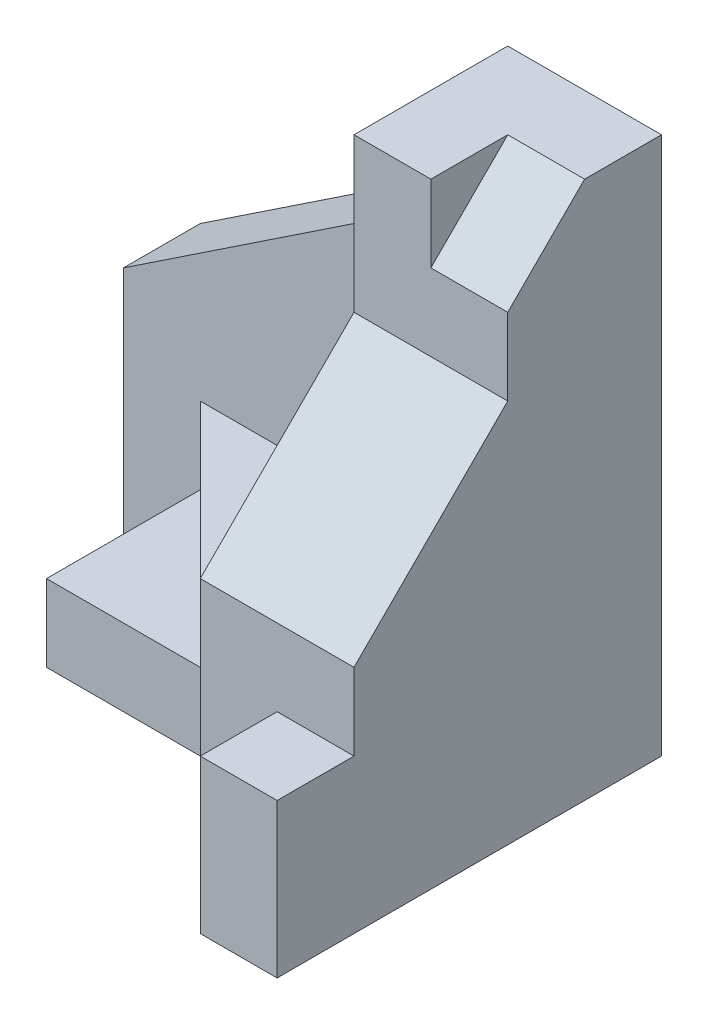
ISO-10303-21;
HEADER;
FILE_DESCRIPTION(('STEP AP214'),'2;1');
FILE_NAME('part.step','',(''),(''),'','','');
FILE_SCHEMA(('AUTOMOTIVE_DESIGN { 1 0 10303 214 1 1 1 1 }'));
ENDSEC;
DATA;
#1=APPLICATION_CONTEXT('core data for automotive mechanical design processes');
#2=APPLICATION_PROTOCOL_DEFINITION('international standard','automotive_design',2000,#1);
#3=PRODUCT_CONTEXT('',#1,'mechanical');
#4=PRODUCT('Part','Part','',(#3));
#5=PRODUCT_RELATED_PRODUCT_CATEGORY('part','',(#4));
#6=PRODUCT_DEFINITION_FORMATION('','',#4);
#7=PRODUCT_DEFINITION_CONTEXT('part definition',#1,'design');
#8=PRODUCT_DEFINITION('design','',#6,#7);
#9=PRODUCT_DEFINITION_SHAPE('','',#8);
#10=(LENGTH_UNIT() NAMED_UNIT(*) SI_UNIT(.MILLI.,.METRE.));
#11=(NAMED_UNIT(*) PLANE_ANGLE_UNIT() SI_UNIT($,.RADIAN.));
#12=(NAMED_UNIT(*) SI_UNIT($,.STERADIAN.) SOLID_ANGLE_UNIT());
#13=UNCERTAINTY_MEASURE_WITH_UNIT(LENGTH_MEASURE(1.E-05),#10,'distance_accuracy_value','');
#14=(GEOMETRIC_REPRESENTATION_CONTEXT(3) GLOBAL_UNCERTAINTY_ASSIGNED_CONTEXT((#13)) GLOBAL_UNIT_ASSIGNED_CONTEXT((#10,
#11,#12)) REPRESENTATION_CONTEXT('',''));
#15=CARTESIAN_POINT('',(0.,0.,0.));
#16=DIRECTION('',(0.,0.,1.));
#17=DIRECTION('',(1.,0.,0.));
#18=AXIS2_PLACEMENT_3D('',#15,#16,#17);
#19=CARTESIAN_POINT('',(0.,50.,0.));
#20=DIRECTION('',(0.,-1.,0.));
#21=DIRECTION('',(0.,0.,-1.));
#22=AXIS2_PLACEMENT_3D('',#19,#20,#21);
#23=PLANE('',#22);
#24=DIRECTION('',(0.,0.,1.));
#25=VECTOR('',#24,1.);
#26=CARTESIAN_POINT('',(40.,50.,19.9999999999999));
#27=LINE('',#26,#25);
#28=CARTESIAN_POINT('',(40.,50.,0.));
#29=VERTEX_POINT('',#28);
#30=CARTESIAN_POINT('',(40.,50.,10.));
#31=VERTEX_POINT('',#30);
#32=EDGE_CURVE('E58',#29,#31,#27,.T.);
#33=ORIENTED_EDGE('',*,*,#32,.F.);
#34=DIRECTION('',(-1.,0.,0.));
#35=VECTOR('',#34,1.);
#36=CARTESIAN_POINT('',(0.,50.,0.));
#37=LINE('',#36,#35);
#38=CARTESIAN_POINT('',(30.0000000000001,50.,0.));
#39=VERTEX_POINT('',#38);
#40=EDGE_CURVE('E210',#29,#39,#37,.T.);
#41=ORIENTED_EDGE('',*,*,#40,.T.);
#42=DIRECTION('',(0.,0.,1.));
#43=VECTOR('',#42,1.);
#44=CARTESIAN_POINT('',(30.0000000000002,50.,0.));
#45=LINE('',#44,#43);
#46=CARTESIAN_POINT('',(30.0000000000001,50.,9.99999999999999));
#47=VERTEX_POINT('',#46);
#48=EDGE_CURVE('E397',#39,#47,#45,.T.);
#49=ORIENTED_EDGE('',*,*,#48,.T.);
#50=DIRECTION('',(1.,0.,0.));
#51=VECTOR('',#50,1.);
#52=CARTESIAN_POINT('',(10.,50.,10.));
#53=LINE('',#52,#51);
#54=EDGE_CURVE('E213',#47,#31,#53,.T.);
#55=ORIENTED_EDGE('',*,*,#54,.T.);
#56=EDGE_LOOP('',(#33,#41,#49,#55));
#57=FACE_BOUND('',#56,.T.);
#58=ADVANCED_FACE('F33',(#57),#23,.F.);
#59=CARTESIAN_POINT('',(0.,20.,0.));
#60=DIRECTION('',(0.,-1.,0.));
#61=DIRECTION('',(0.,0.,-1.));
#62=AXIS2_PLACEMENT_3D('',#59,#60,#61);
#63=PLANE('',#62);
#64=DIRECTION('',(1.,0.,0.));
#65=VECTOR('',#64,1.);
#66=CARTESIAN_POINT('',(40.,20.,40.));
#67=LINE('',#66,#65);
#68=CARTESIAN_POINT('',(50.,20.,40.));
#69=VERTEX_POINT('',#68);
#70=CARTESIAN_POINT('',(60.,20.,40.));
#71=VERTEX_POINT('',#70);
#72=EDGE_CURVE('E252',#69,#71,#67,.T.);
#73=ORIENTED_EDGE('',*,*,#72,.F.);
#74=DIRECTION('',(0.,0.,1.));
#75=VECTOR('',#74,1.);
#76=CARTESIAN_POINT('',(50.,20.,50.));
#77=LINE('',#76,#75);
#78=CARTESIAN_POINT('',(50.,20.,50.));
#79=VERTEX_POINT('',#78);
#80=EDGE_CURVE('E263',#69,#79,#77,.T.);
#81=ORIENTED_EDGE('',*,*,#80,.T.);
#82=DIRECTION('',(1.,0.,0.));
#83=VECTOR('',#82,1.);
#84=CARTESIAN_POINT('',(60.,20.,50.));
#85=LINE('',#84,#83);
#86=CARTESIAN_POINT('',(60.,20.,50.));
#87=VERTEX_POINT('',#86);
#88=EDGE_CURVE('E281',#79,#87,#85,.T.);
#89=ORIENTED_EDGE('',*,*,#88,.T.);
#90=DIRECTION('',(0.,0.,-1.));
#91=VECTOR('',#90,1.);
#92=CARTESIAN_POINT('',(60.,20.,0.));
#93=LINE('',#92,#91);
#94=EDGE_CURVE('E277',#87,#71,#93,.T.);
#95=ORIENTED_EDGE('',*,*,#94,.T.);
#96=EDGE_LOOP('',(#73,#81,#89,#95));
#97=FACE_BOUND('',#96,.T.);
#98=ADVANCED_FACE('F414',(#97),#63,.F.);
#99=DIRECTION('',(0.,0.,1.));
#100=VECTOR('',#99,1.);
#101=CARTESIAN_POINT('',(40.,20.,40.));
#102=LINE('',#101,#100);
#103=CARTESIAN_POINT('',(40.,20.,10.));
#104=VERTEX_POINT('',#103);
#105=CARTESIAN_POINT('',(40.,20.,40.));
#106=VERTEX_POINT('',#105);
#107=EDGE_CURVE('E207',#104,#106,#102,.T.);
#108=ORIENTED_EDGE('',*,*,#107,.F.);
#109=DIRECTION('',(1.,0.,0.));
#110=VECTOR('',#109,1.);
#111=CARTESIAN_POINT('',(40.,20.,10.));
#112=LINE('',#111,#110);
#113=CARTESIAN_POINT('',(10.,20.,10.));
#114=VERTEX_POINT('',#113);
#115=EDGE_CURVE('E242',#114,#104,#112,.T.);
#116=ORIENTED_EDGE('',*,*,#115,.F.);
#117=DIRECTION('',(0.707106781186547,0.,0.707106781186548));
#118=VECTOR('',#117,1.);
#119=CARTESIAN_POINT('',(40.,20.,40.));
#120=LINE('',#119,#118);
#121=EDGE_CURVE('E244',#114,#106,#120,.T.);
#122=ORIENTED_EDGE('',*,*,#121,.T.);
#123=EDGE_LOOP('',(#108,#116,#122));
#124=FACE_BOUND('',#123,.T.);
#125=ADVANCED_FACE('F241',(#124),#63,.F.);
#126=CARTESIAN_POINT('',(0.,20.,10.));
#127=DIRECTION('',(1.,0.,0.));
#128=DIRECTION('',(0.,0.,-1.));
#129=AXIS2_PLACEMENT_3D('',#126,#127,#128);
#130=PLANE('',#129);
#131=DIRECTION('',(0.,-1.,0.));
#132=VECTOR('',#131,1.);
#133=CARTESIAN_POINT('',(0.,20.,10.));
#134=LINE('',#133,#132);
#135=CARTESIAN_POINT('',(0.,30.,10.));
#136=VERTEX_POINT('',#135);
#137=CARTESIAN_POINT('',(0.,0.,10.));
#138=VERTEX_POINT('',#137);
#139=EDGE_CURVE('E253',#136,#138,#134,.T.);
#140=ORIENTED_EDGE('',*,*,#139,.F.);
#141=DIRECTION('',(0.,0.,-1.));
#142=VECTOR('',#141,1.);
#143=CARTESIAN_POINT('',(0.,30.,10.));
#144=LINE('',#143,#142);
#145=CARTESIAN_POINT('',(0.,30.,0.));
#146=VERTEX_POINT('',#145);
#147=EDGE_CURVE('E42',#136,#146,#144,.T.);
#148=ORIENTED_EDGE('',*,*,#147,.T.);
#149=DIRECTION('',(0.,-1.,0.));
#150=VECTOR('',#149,1.);
#151=CARTESIAN_POINT('',(0.,20.,0.));
#152=LINE('',#151,#150);
#153=CARTESIAN_POINT('',(0.,0.,0.));
#154=VERTEX_POINT('',#153);
#155=EDGE_CURVE('E280',#146,#154,#152,.T.);
#156=ORIENTED_EDGE('',*,*,#155,.T.);
#157=DIRECTION('',(0.,0.,1.));
#158=VECTOR('',#157,1.);
#159=CARTESIAN_POINT('',(0.,0.,10.));
#160=LINE('',#159,#158);
#161=EDGE_CURVE('E286',#154,#138,#160,.T.);
#162=ORIENTED_EDGE('',*,*,#161,.T.);
#163=EDGE_LOOP('',(#140,#148,#156,#162));
#164=FACE_BOUND('',#163,.T.);
#165=ADVANCED_FACE('F364',(#164),#130,.F.);
#166=CARTESIAN_POINT('',(10.,20.,10.));
#167=DIRECTION('',(0.,0.,-1.));
#168=DIRECTION('',(-1.,0.,0.));
#169=AXIS2_PLACEMENT_3D('',#166,#167,#168);
#170=PLANE('',#169);
#171=ORIENTED_EDGE('',*,*,#54,.F.);
#172=DIRECTION('',(0.832050294337844,0.554700196225228,0.));
#173=VECTOR('',#172,1.);
#174=CARTESIAN_POINT('',(30.0000000000002,50.,9.99999999999999));
#175=LINE('',#174,#173);
#176=EDGE_CURVE('E400',#47,#136,#175,.F.);
#177=ORIENTED_EDGE('',*,*,#176,.T.);
#178=ORIENTED_EDGE('',*,*,#139,.T.);
#179=DIRECTION('',(1.,0.,0.));
#180=VECTOR('',#179,1.);
#181=CARTESIAN_POINT('',(10.,0.,10.));
#182=LINE('',#181,#180);
#183=CARTESIAN_POINT('',(10.,0.,10.));
#184=VERTEX_POINT('',#183);
#185=EDGE_CURVE('E289',#138,#184,#182,.T.);
#186=ORIENTED_EDGE('',*,*,#185,.T.);
#187=DIRECTION('',(0.,-1.,0.));
#188=VECTOR('',#187,1.);
#189=CARTESIAN_POINT('',(10.,20.,10.));
#190=LINE('',#189,#188);
#191=CARTESIAN_POINT('',(10.,10.,10.));
#192=VERTEX_POINT('',#191);
#193=EDGE_CURVE('E269',#192,#184,#190,.T.);
#194=ORIENTED_EDGE('',*,*,#193,.F.);
#195=EDGE_CURVE('E251',#114,#192,#190,.T.);
#196=ORIENTED_EDGE('',*,*,#195,.F.);
#197=ORIENTED_EDGE('',*,*,#115,.T.);
#198=DIRECTION('',(0.,-1.,0.));
#199=VECTOR('',#198,1.);
#200=CARTESIAN_POINT('',(40.,50.,10.));
#201=LINE('',#200,#199);
#202=EDGE_CURVE('E218',#31,#104,#201,.T.);
#203=ORIENTED_EDGE('',*,*,#202,.F.);
#204=EDGE_LOOP('',(#171,#177,#178,#186,#194,#196,#197,#203));
#205=FACE_BOUND('',#204,.T.);
#206=ADVANCED_FACE('F249',(#205),#170,.F.);
#207=CARTESIAN_POINT('',(10.,20.,30.));
#208=DIRECTION('',(1.,0.,0.));
#209=DIRECTION('',(0.,0.,-1.));
#210=AXIS2_PLACEMENT_3D('',#207,#208,#209);
#211=PLANE('',#210);
#212=DIRECTION('',(0.,-1.,0.));
#213=VECTOR('',#212,1.);
#214=CARTESIAN_POINT('',(10.,20.,30.));
#215=LINE('',#214,#213);
#216=CARTESIAN_POINT('',(10.,10.,30.));
#217=VERTEX_POINT('',#216);
#218=CARTESIAN_POINT('',(10.,0.,30.));
#219=VERTEX_POINT('',#218);
#220=EDGE_CURVE('E274',#217,#219,#215,.T.);
#221=ORIENTED_EDGE('',*,*,#220,.F.);
#222=DIRECTION('',(0.,0.,1.));
#223=VECTOR('',#222,1.);
#224=CARTESIAN_POINT('',(10.,10.,10.));
#225=LINE('',#224,#223);
#226=EDGE_CURVE('E290',#192,#217,#225,.T.);
#227=ORIENTED_EDGE('',*,*,#226,.F.);
#228=ORIENTED_EDGE('',*,*,#193,.T.);
#229=DIRECTION('',(0.,0.,1.));
#230=VECTOR('',#229,1.);
#231=CARTESIAN_POINT('',(10.,0.,30.));
#232=LINE('',#231,#230);
#233=EDGE_CURVE('E293',#184,#219,#232,.T.);
#234=ORIENTED_EDGE('',*,*,#233,.T.);
#235=EDGE_LOOP('',(#221,#227,#228,#234));
#236=FACE_BOUND('',#235,.T.);
#237=ADVANCED_FACE('F337',(#236),#211,.F.);
#238=CARTESIAN_POINT('',(30.,20.,30.));
#239=DIRECTION('',(0.,0.,-1.));
#240=DIRECTION('',(-1.,0.,0.));
#241=AXIS2_PLACEMENT_3D('',#238,#239,#240);
#242=PLANE('',#241);
#243=DIRECTION('',(0.,-1.,0.));
#244=VECTOR('',#243,1.);
#245=CARTESIAN_POINT('',(30.,20.,30.));
#246=LINE('',#245,#244);
#247=CARTESIAN_POINT('',(30.,10.,30.));
#248=VERTEX_POINT('',#247);
#249=CARTESIAN_POINT('',(30.,0.,30.));
#250=VERTEX_POINT('',#249);
#251=EDGE_CURVE('E324',#248,#250,#246,.T.);
#252=ORIENTED_EDGE('',*,*,#251,.F.);
#253=DIRECTION('',(1.,0.,0.));
#254=VECTOR('',#253,1.);
#255=CARTESIAN_POINT('',(10.,10.,30.));
#256=LINE('',#255,#254);
#257=EDGE_CURVE('E221',#217,#248,#256,.T.);
#258=ORIENTED_EDGE('',*,*,#257,.F.);
#259=ORIENTED_EDGE('',*,*,#220,.T.);
#260=DIRECTION('',(1.,0.,0.));
#261=VECTOR('',#260,1.);
#262=CARTESIAN_POINT('',(30.,0.,30.));
#263=LINE('',#262,#261);
#264=EDGE_CURVE('E296',#219,#250,#263,.T.);
#265=ORIENTED_EDGE('',*,*,#264,.T.);
#266=EDGE_LOOP('',(#252,#258,#259,#265));
#267=FACE_BOUND('',#266,.T.);
#268=ADVANCED_FACE('F330',(#267),#242,.F.);
#269=CARTESIAN_POINT('',(40.,20.,40.));
#270=DIRECTION('',(0.707106781186548,0.,-0.707106781186547));
#271=DIRECTION('',(-0.707106781186547,0.,-0.707106781186548));
#272=AXIS2_PLACEMENT_3D('',#269,#270,#271);
#273=PLANE('',#272);
#274=DIRECTION('',(0.707106781186547,0.,0.707106781186548));
#275=VECTOR('',#274,1.);
#276=CARTESIAN_POINT('',(40.,0.,40.));
#277=LINE('',#276,#275);
#278=CARTESIAN_POINT('',(40.,0.,40.));
#279=VERTEX_POINT('',#278);
#280=EDGE_CURVE('E299',#250,#279,#277,.T.);
#281=ORIENTED_EDGE('',*,*,#280,.T.);
#282=DIRECTION('',(0.,-1.,0.));
#283=VECTOR('',#282,1.);
#284=CARTESIAN_POINT('',(40.,20.,40.));
#285=LINE('',#284,#283);
#286=EDGE_CURVE('E322',#106,#279,#285,.T.);
#287=ORIENTED_EDGE('',*,*,#286,.F.);
#288=ORIENTED_EDGE('',*,*,#121,.F.);
#289=ORIENTED_EDGE('',*,*,#195,.T.);
#290=DIRECTION('',(-0.707106781186548,0.,-0.707106781186547));
#291=VECTOR('',#290,1.);
#292=CARTESIAN_POINT('',(30.,10.,30.));
#293=LINE('',#292,#291);
#294=EDGE_CURVE('E357',#248,#192,#293,.T.);
#295=ORIENTED_EDGE('',*,*,#294,.F.);
#296=ORIENTED_EDGE('',*,*,#251,.T.);
#297=EDGE_LOOP('',(#281,#287,#288,#289,#295,#296));
#298=FACE_BOUND('',#297,.T.);
#299=ADVANCED_FACE('F344',(#298),#273,.F.);
#300=CARTESIAN_POINT('',(50.,20.,40.));
#301=DIRECTION('',(0.,0.,-1.));
#302=DIRECTION('',(-1.,0.,0.));
#303=AXIS2_PLACEMENT_3D('',#300,#301,#302);
#304=PLANE('',#303);
#305=DIRECTION('',(0.,-1.,0.));
#306=VECTOR('',#305,1.);
#307=CARTESIAN_POINT('',(60.,50.,40.));
#308=LINE('',#307,#306);
#309=CARTESIAN_POINT('',(60.,29.9999999999999,40.));
#310=VERTEX_POINT('',#309);
#311=EDGE_CURVE('E212',#310,#71,#308,.T.);
#312=ORIENTED_EDGE('',*,*,#311,.F.);
#313=DIRECTION('',(-1.,0.,0.));
#314=VECTOR('',#313,1.);
#315=CARTESIAN_POINT('',(50.,29.9999999999999,40.));
#316=LINE('',#315,#314);
#317=CARTESIAN_POINT('',(40.,29.9999999999999,40.));
#318=VERTEX_POINT('',#317);
#319=EDGE_CURVE('E351',#310,#318,#316,.T.);
#320=ORIENTED_EDGE('',*,*,#319,.T.);
#321=DIRECTION('',(0.,-1.,0.));
#322=VECTOR('',#321,1.);
#323=CARTESIAN_POINT('',(40.,50.,40.));
#324=LINE('',#323,#322);
#325=EDGE_CURVE('E222',#318,#106,#324,.T.);
#326=ORIENTED_EDGE('',*,*,#325,.T.);
#327=ORIENTED_EDGE('',*,*,#286,.T.);
#328=DIRECTION('',(1.,0.,0.));
#329=VECTOR('',#328,1.);
#330=CARTESIAN_POINT('',(50.,0.,40.));
#331=LINE('',#330,#329);
#332=CARTESIAN_POINT('',(50.,0.,40.));
#333=VERTEX_POINT('',#332);
#334=EDGE_CURVE('E301',#279,#333,#331,.T.);
#335=ORIENTED_EDGE('',*,*,#334,.T.);
#336=DIRECTION('',(0.,-1.,0.));
#337=VECTOR('',#336,1.);
#338=CARTESIAN_POINT('',(50.,20.,40.));
#339=LINE('',#338,#337);
#340=EDGE_CURVE('E321',#69,#333,#339,.T.);
#341=ORIENTED_EDGE('',*,*,#340,.F.);
#342=ORIENTED_EDGE('',*,*,#72,.T.);
#343=EDGE_LOOP('',(#312,#320,#326,#327,#335,#341,#342));
#344=FACE_BOUND('',#343,.T.);
#345=ADVANCED_FACE('F347',(#344),#304,.F.);
#346=CARTESIAN_POINT('',(50.,20.,50.));
#347=DIRECTION('',(1.,0.,0.));
#348=DIRECTION('',(0.,0.,-1.));
#349=AXIS2_PLACEMENT_3D('',#346,#347,#348);
#350=PLANE('',#349);
#351=DIRECTION('',(0.,0.,1.));
#352=VECTOR('',#351,1.);
#353=CARTESIAN_POINT('',(50.,0.,50.));
#354=LINE('',#353,#352);
#355=CARTESIAN_POINT('',(50.,0.,50.));
#356=VERTEX_POINT('',#355);
#357=EDGE_CURVE('E303',#333,#356,#354,.T.);
#358=ORIENTED_EDGE('',*,*,#357,.T.);
#359=DIRECTION('',(0.,-1.,0.));
#360=VECTOR('',#359,1.);
#361=CARTESIAN_POINT('',(50.,20.,50.));
#362=LINE('',#361,#360);
#363=EDGE_CURVE('E318',#79,#356,#362,.T.);
#364=ORIENTED_EDGE('',*,*,#363,.F.);
#365=ORIENTED_EDGE('',*,*,#80,.F.);
#366=ORIENTED_EDGE('',*,*,#340,.T.);
#367=EDGE_LOOP('',(#358,#364,#365,#366));
#368=FACE_BOUND('',#367,.T.);
#369=ADVANCED_FACE('F384',(#368),#350,.F.);
#370=CARTESIAN_POINT('',(60.,20.,50.));
#371=DIRECTION('',(0.,0.,-1.));
#372=DIRECTION('',(-1.,0.,0.));
#373=AXIS2_PLACEMENT_3D('',#370,#371,#372);
#374=PLANE('',#373);
#375=DIRECTION('',(1.,0.,0.));
#376=VECTOR('',#375,1.);
#377=CARTESIAN_POINT('',(60.,0.,50.));
#378=LINE('',#377,#376);
#379=CARTESIAN_POINT('',(60.,0.,50.));
#380=VERTEX_POINT('',#379);
#381=EDGE_CURVE('E305',#356,#380,#378,.T.);
#382=ORIENTED_EDGE('',*,*,#381,.T.);
#383=DIRECTION('',(0.,-1.,0.));
#384=VECTOR('',#383,1.);
#385=CARTESIAN_POINT('',(60.,20.,50.));
#386=LINE('',#385,#384);
#387=EDGE_CURVE('E315',#87,#380,#386,.T.);
#388=ORIENTED_EDGE('',*,*,#387,.F.);
#389=ORIENTED_EDGE('',*,*,#88,.F.);
#390=ORIENTED_EDGE('',*,*,#363,.T.);
#391=EDGE_LOOP('',(#382,#388,#389,#390));
#392=FACE_BOUND('',#391,.T.);
#393=ADVANCED_FACE('F380',(#392),#374,.F.);
#394=CARTESIAN_POINT('',(60.,20.,0.));
#395=DIRECTION('',(-1.,0.,0.));
#396=DIRECTION('',(0.,0.,1.));
#397=AXIS2_PLACEMENT_3D('',#394,#395,#396);
#398=PLANE('',#397);
#399=DIRECTION('',(0.,0.,-1.));
#400=VECTOR('',#399,1.);
#401=CARTESIAN_POINT('',(60.,70.,19.9999999999999));
#402=LINE('',#401,#400);
#403=CARTESIAN_POINT('',(60.,70.,9.99999999999992));
#404=VERTEX_POINT('',#403);
#405=CARTESIAN_POINT('',(60.,70.,0.));
#406=VERTEX_POINT('',#405);
#407=EDGE_CURVE('E194',#404,#406,#402,.T.);
#408=ORIENTED_EDGE('',*,*,#407,.F.);
#409=DIRECTION('',(0.,0.707106781186547,-0.707106781186548));
#410=VECTOR('',#409,1.);
#411=CARTESIAN_POINT('',(60.,70.,9.99999999999992));
#412=LINE('',#411,#410);
#413=CARTESIAN_POINT('',(60.,60.,19.9999999999999));
#414=VERTEX_POINT('',#413);
#415=EDGE_CURVE('E178',#414,#404,#412,.T.);
#416=ORIENTED_EDGE('',*,*,#415,.F.);
#417=DIRECTION('',(0.,-1.,0.));
#418=VECTOR('',#417,1.);
#419=CARTESIAN_POINT('',(60.,70.,19.9999999999999));
#420=LINE('',#419,#418);
#421=CARTESIAN_POINT('',(60.,50.,19.9999999999999));
#422=VERTEX_POINT('',#421);
#423=EDGE_CURVE('E183',#414,#422,#420,.T.);
#424=ORIENTED_EDGE('',*,*,#423,.T.);
#425=DIRECTION('',(0.,0.707106781186548,-0.707106781186548));
#426=VECTOR('',#425,1.);
#427=CARTESIAN_POINT('',(60.,50.,19.9999999999999));
#428=LINE('',#427,#426);
#429=EDGE_CURVE('E391',#422,#310,#428,.F.);
#430=ORIENTED_EDGE('',*,*,#429,.T.);
#431=ORIENTED_EDGE('',*,*,#311,.T.);
#432=ORIENTED_EDGE('',*,*,#94,.F.);
#433=ORIENTED_EDGE('',*,*,#387,.T.);
#434=DIRECTION('',(0.,0.,-1.));
#435=VECTOR('',#434,1.);
#436=CARTESIAN_POINT('',(60.,0.,0.));
#437=LINE('',#436,#435);
#438=CARTESIAN_POINT('',(60.,0.,0.));
#439=VERTEX_POINT('',#438);
#440=EDGE_CURVE('E307',#380,#439,#437,.T.);
#441=ORIENTED_EDGE('',*,*,#440,.T.);
#442=DIRECTION('',(0.,-1.,0.));
#443=VECTOR('',#442,1.);
#444=CARTESIAN_POINT('',(60.,20.,0.));
#445=LINE('',#444,#443);
#446=EDGE_CURVE('E312',#406,#439,#445,.T.);
#447=ORIENTED_EDGE('',*,*,#446,.F.);
#448=EDGE_LOOP('',(#408,#416,#424,#430,#431,#432,#433,#441,#447));
#449=FACE_BOUND('',#448,.T.);
#450=ADVANCED_FACE('F375',(#449),#398,.F.);
#451=CARTESIAN_POINT('',(0.,20.,0.));
#452=DIRECTION('',(0.,0.,1.));
#453=DIRECTION('',(1.,0.,0.));
#454=AXIS2_PLACEMENT_3D('',#451,#452,#453);
#455=PLANE('',#454);
#456=ORIENTED_EDGE('',*,*,#155,.F.);
#457=DIRECTION('',(-0.832050294337844,-0.554700196225228,0.));
#458=VECTOR('',#457,1.);
#459=CARTESIAN_POINT('',(30.0000000000002,50.,0.));
#460=LINE('',#459,#458);
#461=EDGE_CURVE('E11',#146,#39,#460,.F.);
#462=ORIENTED_EDGE('',*,*,#461,.T.);
#463=ORIENTED_EDGE('',*,*,#40,.F.);
#464=DIRECTION('',(0.,-1.,0.));
#465=VECTOR('',#464,1.);
#466=CARTESIAN_POINT('',(40.,70.,0.));
#467=LINE('',#466,#465);
#468=CARTESIAN_POINT('',(40.,70.,0.));
#469=VERTEX_POINT('',#468);
#470=EDGE_CURVE('E198',#469,#29,#467,.T.);
#471=ORIENTED_EDGE('',*,*,#470,.F.);
#472=DIRECTION('',(-1.,0.,0.));
#473=VECTOR('',#472,1.);
#474=CARTESIAN_POINT('',(40.,70.,0.));
#475=LINE('',#474,#473);
#476=EDGE_CURVE('E196',#406,#469,#475,.T.);
#477=ORIENTED_EDGE('',*,*,#476,.F.);
#478=ORIENTED_EDGE('',*,*,#446,.T.);
#479=DIRECTION('',(-1.,0.,0.));
#480=VECTOR('',#479,1.);
#481=CARTESIAN_POINT('',(0.,0.,0.));
#482=LINE('',#481,#480);
#483=EDGE_CURVE('E264',#439,#154,#482,.T.);
#484=ORIENTED_EDGE('',*,*,#483,.T.);
#485=EDGE_LOOP('',(#456,#462,#463,#471,#477,#478,#484));
#486=FACE_BOUND('',#485,.T.);
#487=ADVANCED_FACE('F369',(#486),#455,.F.);
#488=CARTESIAN_POINT('',(0.,0.,0.));
#489=DIRECTION('',(0.,-1.,0.));
#490=DIRECTION('',(0.,0.,-1.));
#491=AXIS2_PLACEMENT_3D('',#488,#489,#490);
#492=PLANE('',#491);
#493=ORIENTED_EDGE('',*,*,#161,.F.);
#494=ORIENTED_EDGE('',*,*,#483,.F.);
#495=ORIENTED_EDGE('',*,*,#440,.F.);
#496=ORIENTED_EDGE('',*,*,#381,.F.);
#497=ORIENTED_EDGE('',*,*,#357,.F.);
#498=ORIENTED_EDGE('',*,*,#334,.F.);
#499=ORIENTED_EDGE('',*,*,#280,.F.);
#500=ORIENTED_EDGE('',*,*,#264,.F.);
#501=ORIENTED_EDGE('',*,*,#233,.F.);
#502=ORIENTED_EDGE('',*,*,#185,.F.);
#503=EDGE_LOOP('',(#493,#494,#495,#496,#497,#498,#499,#500,#501,#502));
#504=FACE_BOUND('',#503,.T.);
#505=ADVANCED_FACE('F341',(#504),#492,.T.);
#506=CARTESIAN_POINT('',(0.,10.,0.));
#507=DIRECTION('',(0.,-1.,0.));
#508=DIRECTION('',(0.,0.,-1.));
#509=AXIS2_PLACEMENT_3D('',#506,#507,#508);
#510=PLANE('',#509);
#511=ORIENTED_EDGE('',*,*,#257,.T.);
#512=ORIENTED_EDGE('',*,*,#294,.T.);
#513=ORIENTED_EDGE('',*,*,#226,.T.);
#514=EDGE_LOOP('',(#511,#512,#513));
#515=FACE_BOUND('',#514,.T.);
#516=ADVANCED_FACE('F360',(#515),#510,.F.);
#517=CARTESIAN_POINT('',(40.,50.,40.));
#518=DIRECTION('',(1.,0.,0.));
#519=DIRECTION('',(0.,0.,-1.));
#520=AXIS2_PLACEMENT_3D('',#517,#518,#519);
#521=PLANE('',#520);
#522=ORIENTED_EDGE('',*,*,#325,.F.);
#523=DIRECTION('',(0.,-0.707106781186547,0.707106781186547));
#524=VECTOR('',#523,1.);
#525=CARTESIAN_POINT('',(40.,50.,19.9999999999999));
#526=LINE('',#525,#524);
#527=CARTESIAN_POINT('',(40.,50.,19.9999999999999));
#528=VERTEX_POINT('',#527);
#529=EDGE_CURVE('E395',#318,#528,#526,.F.);
#530=ORIENTED_EDGE('',*,*,#529,.T.);
#531=DIRECTION('',(0.,-1.,0.));
#532=VECTOR('',#531,1.);
#533=CARTESIAN_POINT('',(40.,70.,19.9999999999999));
#534=LINE('',#533,#532);
#535=CARTESIAN_POINT('',(40.,70.,19.9999999999999));
#536=VERTEX_POINT('',#535);
#537=EDGE_CURVE('E204',#536,#528,#534,.T.);
#538=ORIENTED_EDGE('',*,*,#537,.F.);
#539=DIRECTION('',(0.,0.,1.));
#540=VECTOR('',#539,1.);
#541=CARTESIAN_POINT('',(40.,70.,19.9999999999999));
#542=LINE('',#541,#540);
#543=EDGE_CURVE('E189',#469,#536,#542,.T.);
#544=ORIENTED_EDGE('',*,*,#543,.F.);
#545=ORIENTED_EDGE('',*,*,#470,.T.);
#546=ORIENTED_EDGE('',*,*,#32,.T.);
#547=ORIENTED_EDGE('',*,*,#202,.T.);
#548=ORIENTED_EDGE('',*,*,#107,.T.);
#549=EDGE_LOOP('',(#522,#530,#538,#544,#545,#546,#547,#548));
#550=FACE_BOUND('',#549,.T.);
#551=ADVANCED_FACE('F234',(#550),#521,.F.);
#552=CARTESIAN_POINT('',(0.,50.,19.9999999999999));
#553=DIRECTION('',(0.,-0.707106781186547,-0.707106781186547));
#554=DIRECTION('',(1.,0.,0.));
#555=AXIS2_PLACEMENT_3D('',#552,#553,#554);
#556=PLANE('',#555);
#557=ORIENTED_EDGE('',*,*,#529,.F.);
#558=ORIENTED_EDGE('',*,*,#319,.F.);
#559=ORIENTED_EDGE('',*,*,#429,.F.);
#560=DIRECTION('',(1.,0.,0.));
#561=VECTOR('',#560,1.);
#562=CARTESIAN_POINT('',(0.,50.,19.9999999999999));
#563=LINE('',#562,#561);
#564=EDGE_CURVE('E256',#528,#422,#563,.T.);
#565=ORIENTED_EDGE('',*,*,#564,.F.);
#566=EDGE_LOOP('',(#557,#558,#559,#565));
#567=FACE_BOUND('',#566,.T.);
#568=ADVANCED_FACE('F424',(#567),#556,.F.);
#569=CARTESIAN_POINT('',(30.0000000000002,50.,0.));
#570=DIRECTION('',(0.554700196225228,-0.832050294337844,0.));
#571=DIRECTION('',(0.,0.,1.));
#572=AXIS2_PLACEMENT_3D('',#569,#570,#571);
#573=PLANE('',#572);
#574=ORIENTED_EDGE('',*,*,#461,.F.);
#575=ORIENTED_EDGE('',*,*,#147,.F.);
#576=ORIENTED_EDGE('',*,*,#176,.F.);
#577=ORIENTED_EDGE('',*,*,#48,.F.);
#578=EDGE_LOOP('',(#574,#575,#576,#577));
#579=FACE_BOUND('',#578,.T.);
#580=ADVANCED_FACE('F35',(#579),#573,.F.);
#581=CARTESIAN_POINT('',(40.,70.,19.9999999999999));
#582=DIRECTION('',(0.,0.,-1.));
#583=DIRECTION('',(-1.,0.,0.));
#584=AXIS2_PLACEMENT_3D('',#581,#582,#583);
#585=PLANE('',#584);
#586=ORIENTED_EDGE('',*,*,#423,.F.);
#587=DIRECTION('',(1.,0.,0.));
#588=VECTOR('',#587,1.);
#589=CARTESIAN_POINT('',(50.,60.,19.9999999999999));
#590=LINE('',#589,#588);
#591=CARTESIAN_POINT('',(50.,60.,19.9999999999999));
#592=VERTEX_POINT('',#591);
#593=EDGE_CURVE('E166',#592,#414,#590,.T.);
#594=ORIENTED_EDGE('',*,*,#593,.F.);
#595=DIRECTION('',(0.,-1.,0.));
#596=VECTOR('',#595,1.);
#597=CARTESIAN_POINT('',(50.,60.,19.9999999999999));
#598=LINE('',#597,#596);
#599=CARTESIAN_POINT('',(50.,70.,19.9999999999999));
#600=VERTEX_POINT('',#599);
#601=EDGE_CURVE('E172',#600,#592,#598,.T.);
#602=ORIENTED_EDGE('',*,*,#601,.F.);
#603=DIRECTION('',(1.,0.,0.));
#604=VECTOR('',#603,1.);
#605=CARTESIAN_POINT('',(40.,70.,19.9999999999999));
#606=LINE('',#605,#604);
#607=EDGE_CURVE('E192',#536,#600,#606,.T.);
#608=ORIENTED_EDGE('',*,*,#607,.F.);
#609=ORIENTED_EDGE('',*,*,#537,.T.);
#610=ORIENTED_EDGE('',*,*,#564,.T.);
#611=EDGE_LOOP('',(#586,#594,#602,#608,#609,#610));
#612=FACE_BOUND('',#611,.T.);
#613=ADVANCED_FACE('F181',(#612),#585,.F.);
#614=CARTESIAN_POINT('',(0.,70.,0.));
#615=DIRECTION('',(0.,-1.,0.));
#616=DIRECTION('',(0.,0.,-1.));
#617=AXIS2_PLACEMENT_3D('',#614,#615,#616);
#618=PLANE('',#617);
#619=DIRECTION('',(0.,0.,1.));
#620=VECTOR('',#619,1.);
#621=CARTESIAN_POINT('',(50.,70.,19.9999999999999));
#622=LINE('',#621,#620);
#623=CARTESIAN_POINT('',(50.,70.,9.99999999999992));
#624=VERTEX_POINT('',#623);
#625=EDGE_CURVE('E171',#624,#600,#622,.T.);
#626=ORIENTED_EDGE('',*,*,#625,.F.);
#627=DIRECTION('',(1.,0.,0.));
#628=VECTOR('',#627,1.);
#629=CARTESIAN_POINT('',(50.,70.,9.99999999999992));
#630=LINE('',#629,#628);
#631=EDGE_CURVE('E169',#624,#404,#630,.T.);
#632=ORIENTED_EDGE('',*,*,#631,.T.);
#633=ORIENTED_EDGE('',*,*,#407,.T.);
#634=ORIENTED_EDGE('',*,*,#476,.T.);
#635=ORIENTED_EDGE('',*,*,#543,.T.);
#636=ORIENTED_EDGE('',*,*,#607,.T.);
#637=EDGE_LOOP('',(#626,#632,#633,#634,#635,#636));
#638=FACE_BOUND('',#637,.T.);
#639=ADVANCED_FACE('F404',(#638),#618,.F.);
#640=CARTESIAN_POINT('',(50.,70.,9.99999999999992));
#641=DIRECTION('',(0.,-0.707106781186548,-0.707106781186547));
#642=DIRECTION('',(0.,0.707106781186547,-0.707106781186548));
#643=AXIS2_PLACEMENT_3D('',#640,#641,#642);
#644=PLANE('',#643);
#645=ORIENTED_EDGE('',*,*,#415,.T.);
#646=ORIENTED_EDGE('',*,*,#631,.F.);
#647=DIRECTION('',(0.,0.707106781186547,-0.707106781186548));
#648=VECTOR('',#647,1.);
#649=CARTESIAN_POINT('',(50.,70.,9.99999999999992));
#650=LINE('',#649,#648);
#651=EDGE_CURVE('E50',#592,#624,#650,.T.);
#652=ORIENTED_EDGE('',*,*,#651,.F.);
#653=ORIENTED_EDGE('',*,*,#593,.T.);
#654=EDGE_LOOP('',(#645,#646,#652,#653));
#655=FACE_BOUND('',#654,.T.);
#656=ADVANCED_FACE('F164',(#655),#644,.F.);
#657=CARTESIAN_POINT('',(50.,0.,0.));
#658=DIRECTION('',(-1.,0.,0.));
#659=DIRECTION('',(0.,0.,1.));
#660=AXIS2_PLACEMENT_3D('',#657,#658,#659);
#661=PLANE('',#660);
#662=ORIENTED_EDGE('',*,*,#601,.T.);
#663=ORIENTED_EDGE('',*,*,#651,.T.);
#664=ORIENTED_EDGE('',*,*,#625,.T.);
#665=EDGE_LOOP('',(#662,#663,#664));
#666=FACE_BOUND('',#665,.T.);
#667=ADVANCED_FACE('F175',(#666),#661,.F.);
#668=CLOSED_SHELL('',(#58,#98,#125,#165,#206,#237,#268,#299,#345,#369,#393,#450,#487,#505,#516,
#551,#568,#580,#613,#639,#656,#667));
#669=MANIFOLD_SOLID_BREP('B2',#668);
#670=ADVANCED_BREP_SHAPE_REPRESENTATION('',(#18,#669),#14);
#671=SHAPE_DEFINITION_REPRESENTATION(#9,#670);
ENDSEC;
END-ISO-10303-21;
